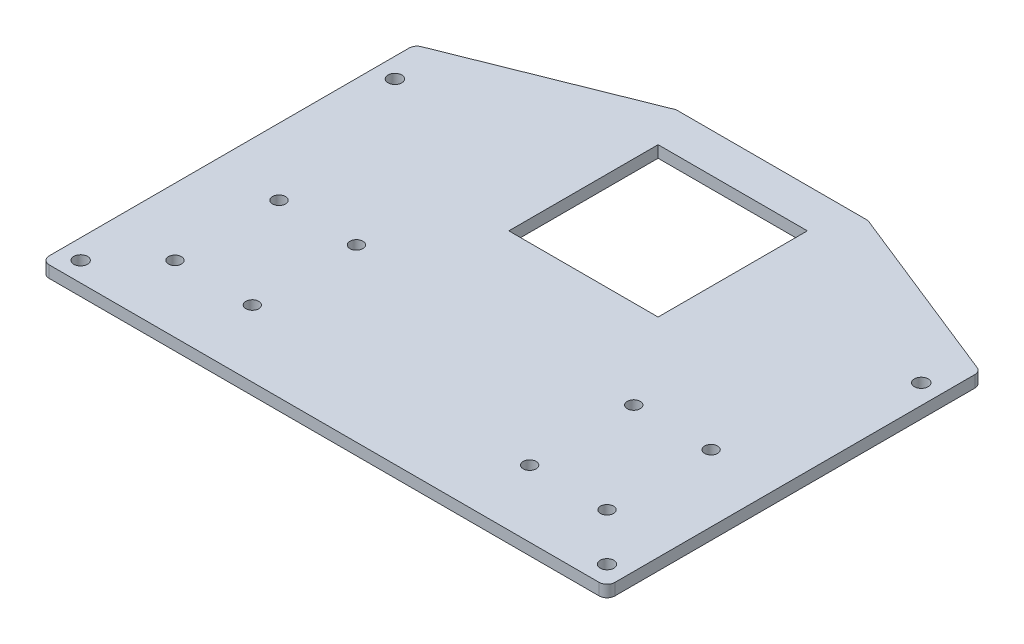
ISO-10303-21;
HEADER;
FILE_DESCRIPTION(('STEP AP214'),'2;1');
FILE_NAME('part.step','',(''),(''),'','','');
FILE_SCHEMA(('AUTOMOTIVE_DESIGN { 1 0 10303 214 1 1 1 1 }'));
ENDSEC;
DATA;
#1=APPLICATION_CONTEXT('core data for automotive mechanical design processes');
#2=APPLICATION_PROTOCOL_DEFINITION('international standard','automotive_design',2000,#1);
#3=PRODUCT_CONTEXT('',#1,'mechanical');
#4=PRODUCT('Part','Part','',(#3));
#5=PRODUCT_RELATED_PRODUCT_CATEGORY('part','',(#4));
#6=PRODUCT_DEFINITION_FORMATION('','',#4);
#7=PRODUCT_DEFINITION_CONTEXT('part definition',#1,'design');
#8=PRODUCT_DEFINITION('design','',#6,#7);
#9=PRODUCT_DEFINITION_SHAPE('','',#8);
#10=(LENGTH_UNIT() NAMED_UNIT(*) SI_UNIT(.MILLI.,.METRE.));
#11=(NAMED_UNIT(*) PLANE_ANGLE_UNIT() SI_UNIT($,.RADIAN.));
#12=(NAMED_UNIT(*) SI_UNIT($,.STERADIAN.) SOLID_ANGLE_UNIT());
#13=UNCERTAINTY_MEASURE_WITH_UNIT(LENGTH_MEASURE(1.E-05),#10,'distance_accuracy_value','');
#14=(GEOMETRIC_REPRESENTATION_CONTEXT(3) GLOBAL_UNCERTAINTY_ASSIGNED_CONTEXT((#13)) GLOBAL_UNIT_ASSIGNED_CONTEXT((#10,
#11,#12)) REPRESENTATION_CONTEXT('',''));
#15=CARTESIAN_POINT('',(0.,0.,0.));
#16=DIRECTION('',(0.,0.,1.));
#17=DIRECTION('',(1.,0.,0.));
#18=AXIS2_PLACEMENT_3D('',#15,#16,#17);
#19=CARTESIAN_POINT('',(-20.833630944789,3.,19.4787401060738));
#20=DIRECTION('',(0.,-1.,0.));
#21=DIRECTION('',(0.,0.,-1.));
#22=AXIS2_PLACEMENT_3D('',#19,#20,#21);
#23=PLANE('',#22);
#24=CARTESIAN_POINT('',(-17.833630944789,3.,16.4787401060738));
#25=DIRECTION('',(0.,1.,0.));
#26=DIRECTION('',(0.,0.,1.));
#27=AXIS2_PLACEMENT_3D('',#24,#25,#26);
#28=CIRCLE('',#27,1.75);
#29=CARTESIAN_POINT('',(-17.833630944789,3.,18.2287401060738));
#30=VERTEX_POINT('',#29);
#31=EDGE_CURVE('E189',#30,#30,#28,.T.);
#32=ORIENTED_EDGE('',*,*,#31,.F.);
#33=EDGE_LOOP('',(#32));
#34=FACE_BOUND('',#33,.T.);
#35=CARTESIAN_POINT('',(116.166369055211,3.,-63.5212598939262));
#36=DIRECTION('',(0.,1.,0.));
#37=DIRECTION('',(0.,0.,1.));
#38=AXIS2_PLACEMENT_3D('',#35,#36,#37);
#39=CIRCLE('',#38,1.75);
#40=CARTESIAN_POINT('',(116.166369055211,3.,-61.7712598939263));
#41=VERTEX_POINT('',#40);
#42=EDGE_CURVE('E194',#41,#41,#39,.T.);
#43=ORIENTED_EDGE('',*,*,#42,.F.);
#44=EDGE_LOOP('',(#43));
#45=FACE_BOUND('',#44,.T.);
#46=CARTESIAN_POINT('',(-17.833630944789,3.,-63.5212598939262));
#47=DIRECTION('',(0.,1.,0.));
#48=DIRECTION('',(0.,0.,1.));
#49=AXIS2_PLACEMENT_3D('',#46,#47,#48);
#50=CIRCLE('',#49,1.75);
#51=CARTESIAN_POINT('',(-17.833630944789,3.,-61.7712598939262));
#52=VERTEX_POINT('',#51);
#53=EDGE_CURVE('E184',#52,#52,#50,.T.);
#54=ORIENTED_EDGE('',*,*,#53,.F.);
#55=EDGE_LOOP('',(#54));
#56=FACE_BOUND('',#55,.T.);
#57=DIRECTION('',(-1.,0.,0.));
#58=VECTOR('',#57,1.);
#59=CARTESIAN_POINT('',(30.166369055211,3.,-82.5212598939263));
#60=LINE('',#59,#58);
#61=CARTESIAN_POINT('',(68.166369055211,3.,-82.5212598939263));
#62=VERTEX_POINT('',#61);
#63=CARTESIAN_POINT('',(30.166369055211,3.,-82.5212598939263));
#64=VERTEX_POINT('',#63);
#65=EDGE_CURVE('E167',#62,#64,#60,.T.);
#66=ORIENTED_EDGE('',*,*,#65,.F.);
#67=DIRECTION('',(0.,0.,-1.));
#68=VECTOR('',#67,1.);
#69=CARTESIAN_POINT('',(68.166369055211,3.,-82.5212598939263));
#70=LINE('',#69,#68);
#71=CARTESIAN_POINT('',(68.166369055211,3.,-44.5212598939263));
#72=VERTEX_POINT('',#71);
#73=EDGE_CURVE('E57',#72,#62,#70,.T.);
#74=ORIENTED_EDGE('',*,*,#73,.F.);
#75=DIRECTION('',(1.,0.,0.));
#76=VECTOR('',#75,1.);
#77=CARTESIAN_POINT('',(30.166369055211,3.,-44.5212598939263));
#78=LINE('',#77,#76);
#79=CARTESIAN_POINT('',(30.166369055211,3.,-44.5212598939263));
#80=VERTEX_POINT('',#79);
#81=EDGE_CURVE('E174',#80,#72,#78,.T.);
#82=ORIENTED_EDGE('',*,*,#81,.F.);
#83=DIRECTION('',(0.,0.,1.));
#84=VECTOR('',#83,1.);
#85=CARTESIAN_POINT('',(30.166369055211,3.,-82.5212598939263));
#86=LINE('',#85,#84);
#87=EDGE_CURVE('E157',#64,#80,#86,.T.);
#88=ORIENTED_EDGE('',*,*,#87,.F.);
#89=EDGE_LOOP('',(#66,#74,#82,#88));
#90=FACE_BOUND('',#89,.T.);
#91=CARTESIAN_POINT('',(116.166369055211,3.,16.4787401060738));
#92=DIRECTION('',(0.,1.,0.));
#93=DIRECTION('',(0.,0.,1.));
#94=AXIS2_PLACEMENT_3D('',#91,#92,#93);
#95=CIRCLE('',#94,1.75);
#96=CARTESIAN_POINT('',(116.166369055211,3.,18.2287401060738));
#97=VERTEX_POINT('',#96);
#98=EDGE_CURVE('E193',#97,#97,#95,.T.);
#99=ORIENTED_EDGE('',*,*,#98,.F.);
#100=EDGE_LOOP('',(#99));
#101=FACE_BOUND('',#100,.T.);
#102=CARTESIAN_POINT('',(84.4663690552109,3.,-22.0212598939262));
#103=DIRECTION('',(0.,1.,0.));
#104=DIRECTION('',(0.,0.,-1.));
#105=AXIS2_PLACEMENT_3D('',#102,#103,#104);
#106=CIRCLE('',#105,1.65);
#107=CARTESIAN_POINT('',(84.4663690552109,3.,-23.6712598939262));
#108=VERTEX_POINT('',#107);
#109=EDGE_CURVE('E325',#108,#108,#106,.T.);
#110=ORIENTED_EDGE('',*,*,#109,.F.);
#111=EDGE_LOOP('',(#110));
#112=FACE_BOUND('',#111,.T.);
#113=CARTESIAN_POINT('',(104.166369055211,3.,-22.0212598939262));
#114=DIRECTION('',(0.,1.,0.));
#115=DIRECTION('',(0.,0.,-1.));
#116=AXIS2_PLACEMENT_3D('',#113,#114,#115);
#117=CIRCLE('',#116,1.64999999999999);
#118=CARTESIAN_POINT('',(104.166369055211,3.,-23.6712598939262));
#119=VERTEX_POINT('',#118);
#120=EDGE_CURVE('E333',#119,#119,#117,.T.);
#121=ORIENTED_EDGE('',*,*,#120,.F.);
#122=EDGE_LOOP('',(#121));
#123=FACE_BOUND('',#122,.T.);
#124=CARTESIAN_POINT('',(104.166369055211,3.,4.47874010607376));
#125=DIRECTION('',(0.,1.,0.));
#126=DIRECTION('',(0.,0.,-1.));
#127=AXIS2_PLACEMENT_3D('',#124,#125,#126);
#128=CIRCLE('',#127,1.64999999999999);
#129=CARTESIAN_POINT('',(104.166369055211,3.,2.82874010607378));
#130=VERTEX_POINT('',#129);
#131=EDGE_CURVE('E341',#130,#130,#128,.T.);
#132=ORIENTED_EDGE('',*,*,#131,.F.);
#133=EDGE_LOOP('',(#132));
#134=FACE_BOUND('',#133,.T.);
#135=CARTESIAN_POINT('',(84.466369055211,3.,4.47874010607377));
#136=DIRECTION('',(0.,1.,0.));
#137=DIRECTION('',(0.,0.,-1.));
#138=AXIS2_PLACEMENT_3D('',#135,#136,#137);
#139=CIRCLE('',#138,1.65);
#140=CARTESIAN_POINT('',(84.466369055211,3.,2.82874010607377));
#141=VERTEX_POINT('',#140);
#142=EDGE_CURVE('E349',#141,#141,#139,.T.);
#143=ORIENTED_EDGE('',*,*,#142,.F.);
#144=EDGE_LOOP('',(#143));
#145=FACE_BOUND('',#144,.T.);
#146=CARTESIAN_POINT('',(13.866369055211,3.,4.47874010607378));
#147=DIRECTION('',(0.,1.,0.));
#148=DIRECTION('',(0.,0.,1.));
#149=AXIS2_PLACEMENT_3D('',#146,#147,#148);
#150=CIRCLE('',#149,1.65);
#151=CARTESIAN_POINT('',(13.866369055211,3.,6.12874010607378));
#152=VERTEX_POINT('',#151);
#153=EDGE_CURVE('E357',#152,#152,#150,.T.);
#154=ORIENTED_EDGE('',*,*,#153,.F.);
#155=EDGE_LOOP('',(#154));
#156=FACE_BOUND('',#155,.T.);
#157=CARTESIAN_POINT('',(-5.83363094478902,3.,4.47874010607378));
#158=DIRECTION('',(0.,1.,0.));
#159=DIRECTION('',(0.,0.,1.));
#160=AXIS2_PLACEMENT_3D('',#157,#158,#159);
#161=CIRCLE('',#160,1.65);
#162=CARTESIAN_POINT('',(-5.83363094478902,3.,6.12874010607378));
#163=VERTEX_POINT('',#162);
#164=EDGE_CURVE('E365',#163,#163,#161,.T.);
#165=ORIENTED_EDGE('',*,*,#164,.F.);
#166=EDGE_LOOP('',(#165));
#167=FACE_BOUND('',#166,.T.);
#168=CARTESIAN_POINT('',(13.866369055211,3.,-22.0212598939262));
#169=DIRECTION('',(0.,1.,0.));
#170=DIRECTION('',(0.,0.,1.));
#171=AXIS2_PLACEMENT_3D('',#168,#169,#170);
#172=CIRCLE('',#171,1.65);
#173=CARTESIAN_POINT('',(13.866369055211,3.,-20.3712598939262));
#174=VERTEX_POINT('',#173);
#175=EDGE_CURVE('E373',#174,#174,#172,.T.);
#176=ORIENTED_EDGE('',*,*,#175,.F.);
#177=EDGE_LOOP('',(#176));
#178=FACE_BOUND('',#177,.T.);
#179=CARTESIAN_POINT('',(-5.83363094478902,3.,-22.0212598939262));
#180=DIRECTION('',(0.,1.,0.));
#181=DIRECTION('',(0.,0.,1.));
#182=AXIS2_PLACEMENT_3D('',#179,#180,#181);
#183=CIRCLE('',#182,1.65);
#184=CARTESIAN_POINT('',(-5.83363094478902,3.,-20.3712598939262));
#185=VERTEX_POINT('',#184);
#186=EDGE_CURVE('E381',#185,#185,#183,.T.);
#187=ORIENTED_EDGE('',*,*,#186,.F.);
#188=EDGE_LOOP('',(#187));
#189=FACE_BOUND('',#188,.T.);
#190=CARTESIAN_POINT('',(119.166369055211,3.,19.4787401060738));
#191=DIRECTION('',(0.,-1.,0.));
#192=DIRECTION('',(0.,0.,-1.));
#193=AXIS2_PLACEMENT_3D('',#190,#191,#192);
#194=CIRCLE('',#193,1.99999999999999);
#195=CARTESIAN_POINT('',(121.166369055211,3.,19.4787401060737));
#196=VERTEX_POINT('',#195);
#197=CARTESIAN_POINT('',(119.166369055211,3.,21.4787401060738));
#198=VERTEX_POINT('',#197);
#199=EDGE_CURVE('E320',#196,#198,#194,.T.);
#200=ORIENTED_EDGE('',*,*,#199,.F.);
#201=DIRECTION('',(0.,0.,1.));
#202=VECTOR('',#201,1.);
#203=CARTESIAN_POINT('',(121.166369055211,3.,19.4787401060738));
#204=LINE('',#203,#202);
#205=CARTESIAN_POINT('',(121.166369055211,3.,-72.1360950867917));
#206=VERTEX_POINT('',#205);
#207=EDGE_CURVE('E317',#206,#196,#204,.T.);
#208=ORIENTED_EDGE('',*,*,#207,.F.);
#209=CARTESIAN_POINT('',(119.166369055211,3.,-72.1360950867917));
#210=DIRECTION('',(0.,-1.,0.));
#211=DIRECTION('',(0.,0.,-1.));
#212=AXIS2_PLACEMENT_3D('',#209,#210,#211);
#213=CIRCLE('',#212,2.00000000000001);
#214=CARTESIAN_POINT('',(119.909150407919,3.,-73.9930484685623));
#215=VERTEX_POINT('',#214);
#216=EDGE_CURVE('E314',#215,#206,#213,.T.);
#217=ORIENTED_EDGE('',*,*,#216,.F.);
#218=DIRECTION('',(0.92847669088526,0.,0.371390676354103));
#219=VECTOR('',#218,1.);
#220=CARTESIAN_POINT('',(30.8108177158038,3.,-109.632381545408));
#221=LINE('',#220,#219);
#222=CARTESIAN_POINT('',(73.9462383900829,3.,-92.3782132756968));
#223=VERTEX_POINT('',#222);
#224=EDGE_CURVE('E311',#223,#215,#221,.T.);
#225=ORIENTED_EDGE('',*,*,#224,.F.);
#226=CARTESIAN_POINT('',(73.2034570373747,3.,-90.5212598939262));
#227=DIRECTION('',(0.,-1.,0.));
#228=DIRECTION('',(0.,0.,-1.));
#229=AXIS2_PLACEMENT_3D('',#226,#227,#228);
#230=CIRCLE('',#229,2.00000000000001);
#231=CARTESIAN_POINT('',(73.2034570373747,3.,-92.5212598939262));
#232=VERTEX_POINT('',#231);
#233=EDGE_CURVE('E308',#232,#223,#230,.T.);
#234=ORIENTED_EDGE('',*,*,#233,.F.);
#235=DIRECTION('',(1.,0.,0.));
#236=VECTOR('',#235,1.);
#237=CARTESIAN_POINT('',(-20.833630944789,3.,-92.5212598939262));
#238=LINE('',#237,#236);
#239=CARTESIAN_POINT('',(25.1292810730472,3.,-92.5212598939262));
#240=VERTEX_POINT('',#239);
#241=EDGE_CURVE('E305',#240,#232,#238,.T.);
#242=ORIENTED_EDGE('',*,*,#241,.F.);
#243=CARTESIAN_POINT('',(25.1292810730472,3.,-90.5212598939262));
#244=DIRECTION('',(0.,-1.,0.));
#245=DIRECTION('',(0.,0.,-1.));
#246=AXIS2_PLACEMENT_3D('',#243,#244,#245);
#247=CIRCLE('',#246,2.);
#248=CARTESIAN_POINT('',(24.386499720339,3.,-92.3782132756968));
#249=VERTEX_POINT('',#248);
#250=EDGE_CURVE('E302',#249,#240,#247,.T.);
#251=ORIENTED_EDGE('',*,*,#250,.F.);
#252=DIRECTION('',(0.928476690885259,0.,-0.371390676354104));
#253=VECTOR('',#252,1.);
#254=CARTESIAN_POINT('',(-53.1677347777957,3.,-61.3565194764428));
#255=LINE('',#254,#253);
#256=CARTESIAN_POINT('',(-21.5764122974972,3.,-73.9930484685623));
#257=VERTEX_POINT('',#256);
#258=EDGE_CURVE('E299',#257,#249,#255,.T.);
#259=ORIENTED_EDGE('',*,*,#258,.F.);
#260=CARTESIAN_POINT('',(-20.833630944789,3.,-72.1360950867917));
#261=DIRECTION('',(0.,-1.,0.));
#262=DIRECTION('',(0.,0.,-1.));
#263=AXIS2_PLACEMENT_3D('',#260,#261,#262);
#264=CIRCLE('',#263,2.);
#265=CARTESIAN_POINT('',(-22.833630944789,3.,-72.1360950867917));
#266=VERTEX_POINT('',#265);
#267=EDGE_CURVE('E296',#266,#257,#264,.T.);
#268=ORIENTED_EDGE('',*,*,#267,.F.);
#269=DIRECTION('',(0.,0.,-1.));
#270=VECTOR('',#269,1.);
#271=CARTESIAN_POINT('',(-22.833630944789,3.,19.4787401060738));
#272=LINE('',#271,#270);
#273=CARTESIAN_POINT('',(-22.833630944789,3.,19.4787401060738));
#274=VERTEX_POINT('',#273);
#275=EDGE_CURVE('E293',#274,#266,#272,.T.);
#276=ORIENTED_EDGE('',*,*,#275,.F.);
#277=CARTESIAN_POINT('',(-20.833630944789,3.,19.4787401060738));
#278=DIRECTION('',(0.,-1.,0.));
#279=DIRECTION('',(0.,0.,-1.));
#280=AXIS2_PLACEMENT_3D('',#277,#278,#279);
#281=CIRCLE('',#280,1.99999999999999);
#282=CARTESIAN_POINT('',(-20.833630944789,3.,21.4787401060738));
#283=VERTEX_POINT('',#282);
#284=EDGE_CURVE('E290',#283,#274,#281,.T.);
#285=ORIENTED_EDGE('',*,*,#284,.F.);
#286=DIRECTION('',(-1.,0.,0.));
#287=VECTOR('',#286,1.);
#288=CARTESIAN_POINT('',(-20.833630944789,3.,21.4787401060738));
#289=LINE('',#288,#287);
#290=EDGE_CURVE('E254',#198,#283,#289,.T.);
#291=ORIENTED_EDGE('',*,*,#290,.F.);
#292=EDGE_LOOP('',(#200,#208,#217,#225,#234,#242,#251,#259,#268,#276,#285,#291));
#293=FACE_BOUND('',#292,.T.);
#294=ADVANCED_FACE('F39',(#34,#45,#56,#90,#101,#112,#123,#134,#145,#156,#167,#178,#189,#293),
#23,.F.);
#295=CARTESIAN_POINT('',(-20.833630944789,0.,19.4787401060738));
#296=DIRECTION('',(0.,-1.,0.));
#297=DIRECTION('',(0.,0.,-1.));
#298=AXIS2_PLACEMENT_3D('',#295,#296,#297);
#299=PLANE('',#298);
#300=CARTESIAN_POINT('',(-17.833630944789,0.,16.4787401060738));
#301=DIRECTION('',(0.,-1.,0.));
#302=DIRECTION('',(0.,0.,-1.));
#303=AXIS2_PLACEMENT_3D('',#300,#301,#302);
#304=CIRCLE('',#303,1.75);
#305=CARTESIAN_POINT('',(-17.833630944789,0.,14.7287401060738));
#306=VERTEX_POINT('',#305);
#307=EDGE_CURVE('E43',#306,#306,#304,.T.);
#308=ORIENTED_EDGE('',*,*,#307,.F.);
#309=EDGE_LOOP('',(#308));
#310=FACE_BOUND('',#309,.T.);
#311=CARTESIAN_POINT('',(116.166369055211,0.,-63.5212598939262));
#312=DIRECTION('',(0.,-1.,0.));
#313=DIRECTION('',(0.,0.,-1.));
#314=AXIS2_PLACEMENT_3D('',#311,#312,#313);
#315=CIRCLE('',#314,1.75);
#316=CARTESIAN_POINT('',(116.166369055211,0.,-65.2712598939263));
#317=VERTEX_POINT('',#316);
#318=EDGE_CURVE('E401',#317,#317,#315,.T.);
#319=ORIENTED_EDGE('',*,*,#318,.F.);
#320=EDGE_LOOP('',(#319));
#321=FACE_BOUND('',#320,.T.);
#322=CARTESIAN_POINT('',(-17.833630944789,0.,-63.5212598939262));
#323=DIRECTION('',(0.,-1.,0.));
#324=DIRECTION('',(0.,0.,-1.));
#325=AXIS2_PLACEMENT_3D('',#322,#323,#324);
#326=CIRCLE('',#325,1.75);
#327=CARTESIAN_POINT('',(-17.833630944789,0.,-65.2712598939263));
#328=VERTEX_POINT('',#327);
#329=EDGE_CURVE('E392',#328,#328,#326,.T.);
#330=ORIENTED_EDGE('',*,*,#329,.F.);
#331=EDGE_LOOP('',(#330));
#332=FACE_BOUND('',#331,.T.);
#333=DIRECTION('',(0.,0.,1.));
#334=VECTOR('',#333,1.);
#335=CARTESIAN_POINT('',(68.166369055211,0.,19.4787401060737));
#336=LINE('',#335,#334);
#337=CARTESIAN_POINT('',(68.166369055211,0.,-82.5212598939263));
#338=VERTEX_POINT('',#337);
#339=CARTESIAN_POINT('',(68.166369055211,0.,-44.5212598939263));
#340=VERTEX_POINT('',#339);
#341=EDGE_CURVE('E11',#338,#340,#336,.T.);
#342=ORIENTED_EDGE('',*,*,#341,.F.);
#343=DIRECTION('',(1.,0.,0.));
#344=VECTOR('',#343,1.);
#345=CARTESIAN_POINT('',(-20.833630944789,0.,-82.5212598939263));
#346=LINE('',#345,#344);
#347=CARTESIAN_POINT('',(30.166369055211,0.,-82.5212598939263));
#348=VERTEX_POINT('',#347);
#349=EDGE_CURVE('E385',#348,#338,#346,.T.);
#350=ORIENTED_EDGE('',*,*,#349,.F.);
#351=DIRECTION('',(0.,0.,-1.));
#352=VECTOR('',#351,1.);
#353=CARTESIAN_POINT('',(30.166369055211,0.,19.4787401060738));
#354=LINE('',#353,#352);
#355=CARTESIAN_POINT('',(30.166369055211,0.,-44.5212598939263));
#356=VERTEX_POINT('',#355);
#357=EDGE_CURVE('E160',#356,#348,#354,.T.);
#358=ORIENTED_EDGE('',*,*,#357,.F.);
#359=DIRECTION('',(-1.,0.,0.));
#360=VECTOR('',#359,1.);
#361=CARTESIAN_POINT('',(-20.833630944789,0.,-44.5212598939263));
#362=LINE('',#361,#360);
#363=EDGE_CURVE('E49',#340,#356,#362,.T.);
#364=ORIENTED_EDGE('',*,*,#363,.F.);
#365=EDGE_LOOP('',(#342,#350,#358,#364));
#366=FACE_BOUND('',#365,.T.);
#367=CARTESIAN_POINT('',(116.166369055211,0.,16.4787401060738));
#368=DIRECTION('',(0.,-1.,0.));
#369=DIRECTION('',(0.,0.,-1.));
#370=AXIS2_PLACEMENT_3D('',#367,#368,#369);
#371=CIRCLE('',#370,1.75);
#372=CARTESIAN_POINT('',(116.166369055211,0.,14.7287401060738));
#373=VERTEX_POINT('',#372);
#374=EDGE_CURVE('E201',#373,#373,#371,.T.);
#375=ORIENTED_EDGE('',*,*,#374,.F.);
#376=EDGE_LOOP('',(#375));
#377=FACE_BOUND('',#376,.T.);
#378=CARTESIAN_POINT('',(84.4663690552109,0.,-22.0212598939262));
#379=DIRECTION('',(0.,1.,0.));
#380=DIRECTION('',(0.,0.,-1.));
#381=AXIS2_PLACEMENT_3D('',#378,#379,#380);
#382=CIRCLE('',#381,1.65);
#383=CARTESIAN_POINT('',(84.4663690552109,0.,-23.6712598939262));
#384=VERTEX_POINT('',#383);
#385=EDGE_CURVE('E324',#384,#384,#382,.T.);
#386=ORIENTED_EDGE('',*,*,#385,.T.);
#387=EDGE_LOOP('',(#386));
#388=FACE_BOUND('',#387,.T.);
#389=CARTESIAN_POINT('',(104.166369055211,0.,4.47874010607376));
#390=DIRECTION('',(0.,1.,0.));
#391=DIRECTION('',(0.,0.,-1.));
#392=AXIS2_PLACEMENT_3D('',#389,#390,#391);
#393=CIRCLE('',#392,1.64999999999999);
#394=CARTESIAN_POINT('',(104.166369055211,0.,2.82874010607378));
#395=VERTEX_POINT('',#394);
#396=EDGE_CURVE('E337',#395,#395,#393,.T.);
#397=ORIENTED_EDGE('',*,*,#396,.T.);
#398=EDGE_LOOP('',(#397));
#399=FACE_BOUND('',#398,.T.);
#400=CARTESIAN_POINT('',(13.866369055211,0.,4.47874010607378));
#401=DIRECTION('',(0.,1.,0.));
#402=DIRECTION('',(0.,0.,1.));
#403=AXIS2_PLACEMENT_3D('',#400,#401,#402);
#404=CIRCLE('',#403,1.65);
#405=CARTESIAN_POINT('',(13.866369055211,0.,6.12874010607378));
#406=VERTEX_POINT('',#405);
#407=EDGE_CURVE('E353',#406,#406,#404,.T.);
#408=ORIENTED_EDGE('',*,*,#407,.T.);
#409=EDGE_LOOP('',(#408));
#410=FACE_BOUND('',#409,.T.);
#411=CARTESIAN_POINT('',(13.866369055211,0.,-22.0212598939262));
#412=DIRECTION('',(0.,1.,0.));
#413=DIRECTION('',(0.,0.,1.));
#414=AXIS2_PLACEMENT_3D('',#411,#412,#413);
#415=CIRCLE('',#414,1.65);
#416=CARTESIAN_POINT('',(13.866369055211,0.,-20.3712598939262));
#417=VERTEX_POINT('',#416);
#418=EDGE_CURVE('E369',#417,#417,#415,.T.);
#419=ORIENTED_EDGE('',*,*,#418,.T.);
#420=EDGE_LOOP('',(#419));
#421=FACE_BOUND('',#420,.T.);
#422=CARTESIAN_POINT('',(-5.83363094478902,0.,-22.0212598939262));
#423=DIRECTION('',(0.,1.,0.));
#424=DIRECTION('',(0.,0.,1.));
#425=AXIS2_PLACEMENT_3D('',#422,#423,#424);
#426=CIRCLE('',#425,1.65);
#427=CARTESIAN_POINT('',(-5.83363094478902,0.,-20.3712598939262));
#428=VERTEX_POINT('',#427);
#429=EDGE_CURVE('E377',#428,#428,#426,.T.);
#430=ORIENTED_EDGE('',*,*,#429,.T.);
#431=EDGE_LOOP('',(#430));
#432=FACE_BOUND('',#431,.T.);
#433=CARTESIAN_POINT('',(-5.83363094478902,0.,4.47874010607378));
#434=DIRECTION('',(0.,1.,0.));
#435=DIRECTION('',(0.,0.,1.));
#436=AXIS2_PLACEMENT_3D('',#433,#434,#435);
#437=CIRCLE('',#436,1.65);
#438=CARTESIAN_POINT('',(-5.83363094478902,0.,6.12874010607378));
#439=VERTEX_POINT('',#438);
#440=EDGE_CURVE('E361',#439,#439,#437,.T.);
#441=ORIENTED_EDGE('',*,*,#440,.T.);
#442=EDGE_LOOP('',(#441));
#443=FACE_BOUND('',#442,.T.);
#444=CARTESIAN_POINT('',(84.466369055211,0.,4.47874010607377));
#445=DIRECTION('',(0.,1.,0.));
#446=DIRECTION('',(0.,0.,-1.));
#447=AXIS2_PLACEMENT_3D('',#444,#445,#446);
#448=CIRCLE('',#447,1.65);
#449=CARTESIAN_POINT('',(84.466369055211,0.,2.82874010607377));
#450=VERTEX_POINT('',#449);
#451=EDGE_CURVE('E345',#450,#450,#448,.T.);
#452=ORIENTED_EDGE('',*,*,#451,.T.);
#453=EDGE_LOOP('',(#452));
#454=FACE_BOUND('',#453,.T.);
#455=CARTESIAN_POINT('',(104.166369055211,0.,-22.0212598939262));
#456=DIRECTION('',(0.,1.,0.));
#457=DIRECTION('',(0.,0.,-1.));
#458=AXIS2_PLACEMENT_3D('',#455,#456,#457);
#459=CIRCLE('',#458,1.64999999999999);
#460=CARTESIAN_POINT('',(104.166369055211,0.,-23.6712598939262));
#461=VERTEX_POINT('',#460);
#462=EDGE_CURVE('E329',#461,#461,#459,.T.);
#463=ORIENTED_EDGE('',*,*,#462,.T.);
#464=EDGE_LOOP('',(#463));
#465=FACE_BOUND('',#464,.T.);
#466=DIRECTION('',(0.,0.,1.));
#467=VECTOR('',#466,1.);
#468=CARTESIAN_POINT('',(121.166369055211,0.,-72.1360950867917));
#469=LINE('',#468,#467);
#470=CARTESIAN_POINT('',(121.166369055211,0.,-72.1360950867917));
#471=VERTEX_POINT('',#470);
#472=CARTESIAN_POINT('',(121.166369055211,0.,19.4787401060737));
#473=VERTEX_POINT('',#472);
#474=EDGE_CURVE('E246',#471,#473,#469,.T.);
#475=ORIENTED_EDGE('',*,*,#474,.T.);
#476=CARTESIAN_POINT('',(119.166369055211,0.,19.4787401060738));
#477=DIRECTION('',(0.,-1.,0.));
#478=DIRECTION('',(0.,0.,-1.));
#479=AXIS2_PLACEMENT_3D('',#476,#477,#478);
#480=CIRCLE('',#479,1.99999999999999);
#481=CARTESIAN_POINT('',(119.166369055211,0.,21.4787401060738));
#482=VERTEX_POINT('',#481);
#483=EDGE_CURVE('E202',#473,#482,#480,.T.);
#484=ORIENTED_EDGE('',*,*,#483,.T.);
#485=DIRECTION('',(-1.,0.,0.));
#486=VECTOR('',#485,1.);
#487=CARTESIAN_POINT('',(119.166369055211,0.,21.4787401060738));
#488=LINE('',#487,#486);
#489=CARTESIAN_POINT('',(-20.833630944789,0.,21.4787401060738));
#490=VERTEX_POINT('',#489);
#491=EDGE_CURVE('E206',#482,#490,#488,.T.);
#492=ORIENTED_EDGE('',*,*,#491,.T.);
#493=CARTESIAN_POINT('',(-20.833630944789,0.,19.4787401060738));
#494=DIRECTION('',(0.,-1.,0.));
#495=DIRECTION('',(0.,0.,-1.));
#496=AXIS2_PLACEMENT_3D('',#493,#494,#495);
#497=CIRCLE('',#496,1.99999999999999);
#498=CARTESIAN_POINT('',(-22.833630944789,0.,19.4787401060738));
#499=VERTEX_POINT('',#498);
#500=EDGE_CURVE('E210',#490,#499,#497,.T.);
#501=ORIENTED_EDGE('',*,*,#500,.T.);
#502=DIRECTION('',(0.,0.,-1.));
#503=VECTOR('',#502,1.);
#504=CARTESIAN_POINT('',(-22.833630944789,0.,19.4787401060738));
#505=LINE('',#504,#503);
#506=CARTESIAN_POINT('',(-22.833630944789,0.,-72.1360950867917));
#507=VERTEX_POINT('',#506);
#508=EDGE_CURVE('E214',#499,#507,#505,.T.);
#509=ORIENTED_EDGE('',*,*,#508,.T.);
#510=CARTESIAN_POINT('',(-20.833630944789,0.,-72.1360950867917));
#511=DIRECTION('',(0.,-1.,0.));
#512=DIRECTION('',(0.,0.,-1.));
#513=AXIS2_PLACEMENT_3D('',#510,#511,#512);
#514=CIRCLE('',#513,2.);
#515=CARTESIAN_POINT('',(-21.5764122974972,0.,-73.9930484685623));
#516=VERTEX_POINT('',#515);
#517=EDGE_CURVE('E218',#507,#516,#514,.T.);
#518=ORIENTED_EDGE('',*,*,#517,.T.);
#519=DIRECTION('',(0.928476690885259,0.,-0.371390676354104));
#520=VECTOR('',#519,1.);
#521=CARTESIAN_POINT('',(-21.5764122974972,0.,-73.9930484685623));
#522=LINE('',#521,#520);
#523=CARTESIAN_POINT('',(24.386499720339,0.,-92.3782132756968));
#524=VERTEX_POINT('',#523);
#525=EDGE_CURVE('E222',#516,#524,#522,.T.);
#526=ORIENTED_EDGE('',*,*,#525,.T.);
#527=CARTESIAN_POINT('',(25.1292810730472,0.,-90.5212598939262));
#528=DIRECTION('',(0.,-1.,0.));
#529=DIRECTION('',(0.,0.,-1.));
#530=AXIS2_PLACEMENT_3D('',#527,#528,#529);
#531=CIRCLE('',#530,2.);
#532=CARTESIAN_POINT('',(25.1292810730472,0.,-92.5212598939262));
#533=VERTEX_POINT('',#532);
#534=EDGE_CURVE('E226',#524,#533,#531,.T.);
#535=ORIENTED_EDGE('',*,*,#534,.T.);
#536=DIRECTION('',(1.,0.,0.));
#537=VECTOR('',#536,1.);
#538=CARTESIAN_POINT('',(25.1292810730472,0.,-92.5212598939262));
#539=LINE('',#538,#537);
#540=CARTESIAN_POINT('',(73.2034570373747,0.,-92.5212598939262));
#541=VERTEX_POINT('',#540);
#542=EDGE_CURVE('E230',#533,#541,#539,.T.);
#543=ORIENTED_EDGE('',*,*,#542,.T.);
#544=CARTESIAN_POINT('',(73.2034570373747,0.,-90.5212598939262));
#545=DIRECTION('',(0.,-1.,0.));
#546=DIRECTION('',(0.,0.,-1.));
#547=AXIS2_PLACEMENT_3D('',#544,#545,#546);
#548=CIRCLE('',#547,2.00000000000001);
#549=CARTESIAN_POINT('',(73.9462383900829,0.,-92.3782132756968));
#550=VERTEX_POINT('',#549);
#551=EDGE_CURVE('E234',#541,#550,#548,.T.);
#552=ORIENTED_EDGE('',*,*,#551,.T.);
#553=DIRECTION('',(0.92847669088526,0.,0.371390676354103));
#554=VECTOR('',#553,1.);
#555=CARTESIAN_POINT('',(73.9462383900829,0.,-92.3782132756967));
#556=LINE('',#555,#554);
#557=CARTESIAN_POINT('',(119.909150407919,0.,-73.9930484685623));
#558=VERTEX_POINT('',#557);
#559=EDGE_CURVE('E238',#550,#558,#556,.T.);
#560=ORIENTED_EDGE('',*,*,#559,.T.);
#561=CARTESIAN_POINT('',(119.166369055211,0.,-72.1360950867917));
#562=DIRECTION('',(0.,-1.,0.));
#563=DIRECTION('',(0.,0.,-1.));
#564=AXIS2_PLACEMENT_3D('',#561,#562,#563);
#565=CIRCLE('',#564,2.00000000000001);
#566=EDGE_CURVE('E242',#558,#471,#565,.T.);
#567=ORIENTED_EDGE('',*,*,#566,.T.);
#568=EDGE_LOOP('',(#475,#484,#492,#501,#509,#518,#526,#535,#543,#552,#560,#567));
#569=FACE_BOUND('',#568,.T.);
#570=ADVANCED_FACE('F41',(#310,#321,#332,#366,#377,#388,#399,#410,#421,#432,#443,#454,#465,
#569),#299,.T.);
#571=CARTESIAN_POINT('',(-5.83363094478902,3.,-22.0212598939262));
#572=DIRECTION('',(0.,-1.,0.));
#573=DIRECTION('',(0.,0.,-1.));
#574=AXIS2_PLACEMENT_3D('',#571,#572,#573);
#575=CYLINDRICAL_SURFACE('',#574,1.65);
#576=ORIENTED_EDGE('',*,*,#186,.T.);
#577=EDGE_LOOP('',(#576));
#578=FACE_BOUND('',#577,.T.);
#579=ORIENTED_EDGE('',*,*,#429,.F.);
#580=EDGE_LOOP('',(#579));
#581=FACE_BOUND('',#580,.T.);
#582=ADVANCED_FACE('F415',(#578,#581),#575,.F.);
#583=CARTESIAN_POINT('',(13.866369055211,3.,-22.0212598939262));
#584=DIRECTION('',(0.,-1.,0.));
#585=DIRECTION('',(0.,0.,-1.));
#586=AXIS2_PLACEMENT_3D('',#583,#584,#585);
#587=CYLINDRICAL_SURFACE('',#586,1.65);
#588=ORIENTED_EDGE('',*,*,#175,.T.);
#589=EDGE_LOOP('',(#588));
#590=FACE_BOUND('',#589,.T.);
#591=ORIENTED_EDGE('',*,*,#418,.F.);
#592=EDGE_LOOP('',(#591));
#593=FACE_BOUND('',#592,.T.);
#594=ADVANCED_FACE('F508',(#590,#593),#587,.F.);
#595=CARTESIAN_POINT('',(-5.83363094478902,3.,4.47874010607378));
#596=DIRECTION('',(0.,-1.,0.));
#597=DIRECTION('',(0.,0.,-1.));
#598=AXIS2_PLACEMENT_3D('',#595,#596,#597);
#599=CYLINDRICAL_SURFACE('',#598,1.65);
#600=ORIENTED_EDGE('',*,*,#164,.T.);
#601=EDGE_LOOP('',(#600));
#602=FACE_BOUND('',#601,.T.);
#603=ORIENTED_EDGE('',*,*,#440,.F.);
#604=EDGE_LOOP('',(#603));
#605=FACE_BOUND('',#604,.T.);
#606=ADVANCED_FACE('F512',(#602,#605),#599,.F.);
#607=CARTESIAN_POINT('',(13.866369055211,3.,4.47874010607378));
#608=DIRECTION('',(0.,-1.,0.));
#609=DIRECTION('',(0.,0.,-1.));
#610=AXIS2_PLACEMENT_3D('',#607,#608,#609);
#611=CYLINDRICAL_SURFACE('',#610,1.65);
#612=ORIENTED_EDGE('',*,*,#153,.T.);
#613=EDGE_LOOP('',(#612));
#614=FACE_BOUND('',#613,.T.);
#615=ORIENTED_EDGE('',*,*,#407,.F.);
#616=EDGE_LOOP('',(#615));
#617=FACE_BOUND('',#616,.T.);
#618=ADVANCED_FACE('F516',(#614,#617),#611,.F.);
#619=CARTESIAN_POINT('',(84.466369055211,3.,4.47874010607377));
#620=DIRECTION('',(0.,-1.,0.));
#621=DIRECTION('',(0.,0.,-1.));
#622=AXIS2_PLACEMENT_3D('',#619,#620,#621);
#623=CYLINDRICAL_SURFACE('',#622,1.65);
#624=ORIENTED_EDGE('',*,*,#142,.T.);
#625=EDGE_LOOP('',(#624));
#626=FACE_BOUND('',#625,.T.);
#627=ORIENTED_EDGE('',*,*,#451,.F.);
#628=EDGE_LOOP('',(#627));
#629=FACE_BOUND('',#628,.T.);
#630=ADVANCED_FACE('F520',(#626,#629),#623,.F.);
#631=CARTESIAN_POINT('',(104.166369055211,3.,4.47874010607376));
#632=DIRECTION('',(0.,-1.,0.));
#633=DIRECTION('',(0.,0.,-1.));
#634=AXIS2_PLACEMENT_3D('',#631,#632,#633);
#635=CYLINDRICAL_SURFACE('',#634,1.64999999999999);
#636=ORIENTED_EDGE('',*,*,#131,.T.);
#637=EDGE_LOOP('',(#636));
#638=FACE_BOUND('',#637,.T.);
#639=ORIENTED_EDGE('',*,*,#396,.F.);
#640=EDGE_LOOP('',(#639));
#641=FACE_BOUND('',#640,.T.);
#642=ADVANCED_FACE('F524',(#638,#641),#635,.F.);
#643=CARTESIAN_POINT('',(104.166369055211,3.,-22.0212598939262));
#644=DIRECTION('',(0.,-1.,0.));
#645=DIRECTION('',(0.,0.,-1.));
#646=AXIS2_PLACEMENT_3D('',#643,#644,#645);
#647=CYLINDRICAL_SURFACE('',#646,1.64999999999999);
#648=ORIENTED_EDGE('',*,*,#120,.T.);
#649=EDGE_LOOP('',(#648));
#650=FACE_BOUND('',#649,.T.);
#651=ORIENTED_EDGE('',*,*,#462,.F.);
#652=EDGE_LOOP('',(#651));
#653=FACE_BOUND('',#652,.T.);
#654=ADVANCED_FACE('F528',(#650,#653),#647,.F.);
#655=CARTESIAN_POINT('',(84.4663690552109,3.,-22.0212598939262));
#656=DIRECTION('',(0.,-1.,0.));
#657=DIRECTION('',(0.,0.,-1.));
#658=AXIS2_PLACEMENT_3D('',#655,#656,#657);
#659=CYLINDRICAL_SURFACE('',#658,1.65);
#660=ORIENTED_EDGE('',*,*,#109,.T.);
#661=EDGE_LOOP('',(#660));
#662=FACE_BOUND('',#661,.T.);
#663=ORIENTED_EDGE('',*,*,#385,.F.);
#664=EDGE_LOOP('',(#663));
#665=FACE_BOUND('',#664,.T.);
#666=ADVANCED_FACE('F532',(#662,#665),#659,.F.);
#667=CARTESIAN_POINT('',(119.166369055211,10.,19.4787401060738));
#668=DIRECTION('',(0.,-1.,0.));
#669=DIRECTION('',(0.,0.,-1.));
#670=AXIS2_PLACEMENT_3D('',#667,#668,#669);
#671=CYLINDRICAL_SURFACE('',#670,1.99999999999999);
#672=ORIENTED_EDGE('',*,*,#199,.T.);
#673=DIRECTION('',(0.,-1.,0.));
#674=VECTOR('',#673,1.);
#675=CARTESIAN_POINT('',(119.166369055211,10.,21.4787401060738));
#676=LINE('',#675,#674);
#677=EDGE_CURVE('E250',#198,#482,#676,.T.);
#678=ORIENTED_EDGE('',*,*,#677,.T.);
#679=ORIENTED_EDGE('',*,*,#483,.F.);
#680=DIRECTION('',(0.,-1.,0.));
#681=VECTOR('',#680,1.);
#682=CARTESIAN_POINT('',(121.166369055211,10.,19.4787401060737));
#683=LINE('',#682,#681);
#684=EDGE_CURVE('E251',#196,#473,#683,.T.);
#685=ORIENTED_EDGE('',*,*,#684,.F.);
#686=EDGE_LOOP('',(#672,#678,#679,#685));
#687=FACE_BOUND('',#686,.T.);
#688=ADVANCED_FACE('F450',(#687),#671,.T.);
#689=CARTESIAN_POINT('',(121.166369055211,10.,-72.1360950867917));
#690=DIRECTION('',(1.,0.,0.));
#691=DIRECTION('',(0.,0.,-1.));
#692=AXIS2_PLACEMENT_3D('',#689,#690,#691);
#693=PLANE('',#692);
#694=ORIENTED_EDGE('',*,*,#207,.T.);
#695=ORIENTED_EDGE('',*,*,#684,.T.);
#696=ORIENTED_EDGE('',*,*,#474,.F.);
#697=DIRECTION('',(0.,-1.,0.));
#698=VECTOR('',#697,1.);
#699=CARTESIAN_POINT('',(121.166369055211,10.,-72.1360950867917));
#700=LINE('',#699,#698);
#701=EDGE_CURVE('E255',#206,#471,#700,.T.);
#702=ORIENTED_EDGE('',*,*,#701,.F.);
#703=EDGE_LOOP('',(#694,#695,#696,#702));
#704=FACE_BOUND('',#703,.T.);
#705=ADVANCED_FACE('F445',(#704),#693,.T.);
#706=CARTESIAN_POINT('',(119.166369055211,10.,-72.1360950867917));
#707=DIRECTION('',(0.,-1.,0.));
#708=DIRECTION('',(0.,0.,-1.));
#709=AXIS2_PLACEMENT_3D('',#706,#707,#708);
#710=CYLINDRICAL_SURFACE('',#709,2.00000000000001);
#711=ORIENTED_EDGE('',*,*,#216,.T.);
#712=ORIENTED_EDGE('',*,*,#701,.T.);
#713=ORIENTED_EDGE('',*,*,#566,.F.);
#714=DIRECTION('',(0.,-1.,0.));
#715=VECTOR('',#714,1.);
#716=CARTESIAN_POINT('',(119.909150407919,10.,-73.9930484685623));
#717=LINE('',#716,#715);
#718=EDGE_CURVE('E258',#215,#558,#717,.T.);
#719=ORIENTED_EDGE('',*,*,#718,.F.);
#720=EDGE_LOOP('',(#711,#712,#713,#719));
#721=FACE_BOUND('',#720,.T.);
#722=ADVANCED_FACE('F497',(#721),#710,.T.);
#723=CARTESIAN_POINT('',(73.9462383900829,10.,-92.3782132756967));
#724=DIRECTION('',(0.371390676354103,0.,-0.92847669088526));
#725=DIRECTION('',(-0.92847669088526,0.,-0.371390676354103));
#726=AXIS2_PLACEMENT_3D('',#723,#724,#725);
#727=PLANE('',#726);
#728=ORIENTED_EDGE('',*,*,#224,.T.);
#729=ORIENTED_EDGE('',*,*,#718,.T.);
#730=ORIENTED_EDGE('',*,*,#559,.F.);
#731=DIRECTION('',(0.,-1.,0.));
#732=VECTOR('',#731,1.);
#733=CARTESIAN_POINT('',(73.9462383900829,10.,-92.3782132756968));
#734=LINE('',#733,#732);
#735=EDGE_CURVE('E261',#223,#550,#734,.T.);
#736=ORIENTED_EDGE('',*,*,#735,.F.);
#737=EDGE_LOOP('',(#728,#729,#730,#736));
#738=FACE_BOUND('',#737,.T.);
#739=ADVANCED_FACE('F493',(#738),#727,.T.);
#740=CARTESIAN_POINT('',(73.2034570373747,10.,-90.5212598939262));
#741=DIRECTION('',(0.,-1.,0.));
#742=DIRECTION('',(0.,0.,-1.));
#743=AXIS2_PLACEMENT_3D('',#740,#741,#742);
#744=CYLINDRICAL_SURFACE('',#743,2.00000000000001);
#745=ORIENTED_EDGE('',*,*,#233,.T.);
#746=ORIENTED_EDGE('',*,*,#735,.T.);
#747=ORIENTED_EDGE('',*,*,#551,.F.);
#748=DIRECTION('',(0.,-1.,0.));
#749=VECTOR('',#748,1.);
#750=CARTESIAN_POINT('',(73.2034570373747,10.,-92.5212598939262));
#751=LINE('',#750,#749);
#752=EDGE_CURVE('E264',#232,#541,#751,.T.);
#753=ORIENTED_EDGE('',*,*,#752,.F.);
#754=EDGE_LOOP('',(#745,#746,#747,#753));
#755=FACE_BOUND('',#754,.T.);
#756=ADVANCED_FACE('F488',(#755),#744,.T.);
#757=CARTESIAN_POINT('',(25.1292810730472,10.,-92.5212598939262));
#758=DIRECTION('',(0.,0.,-1.));
#759=DIRECTION('',(-1.,0.,0.));
#760=AXIS2_PLACEMENT_3D('',#757,#758,#759);
#761=PLANE('',#760);
#762=ORIENTED_EDGE('',*,*,#241,.T.);
#763=ORIENTED_EDGE('',*,*,#752,.T.);
#764=ORIENTED_EDGE('',*,*,#542,.F.);
#765=DIRECTION('',(0.,-1.,0.));
#766=VECTOR('',#765,1.);
#767=CARTESIAN_POINT('',(25.1292810730472,10.,-92.5212598939262));
#768=LINE('',#767,#766);
#769=EDGE_CURVE('E267',#240,#533,#768,.T.);
#770=ORIENTED_EDGE('',*,*,#769,.F.);
#771=EDGE_LOOP('',(#762,#763,#764,#770));
#772=FACE_BOUND('',#771,.T.);
#773=ADVANCED_FACE('F483',(#772),#761,.T.);
#774=CARTESIAN_POINT('',(25.1292810730472,10.,-90.5212598939262));
#775=DIRECTION('',(0.,-1.,0.));
#776=DIRECTION('',(0.,0.,-1.));
#777=AXIS2_PLACEMENT_3D('',#774,#775,#776);
#778=CYLINDRICAL_SURFACE('',#777,2.);
#779=ORIENTED_EDGE('',*,*,#250,.T.);
#780=ORIENTED_EDGE('',*,*,#769,.T.);
#781=ORIENTED_EDGE('',*,*,#534,.F.);
#782=DIRECTION('',(0.,-1.,0.));
#783=VECTOR('',#782,1.);
#784=CARTESIAN_POINT('',(24.386499720339,10.,-92.3782132756968));
#785=LINE('',#784,#783);
#786=EDGE_CURVE('E270',#249,#524,#785,.T.);
#787=ORIENTED_EDGE('',*,*,#786,.F.);
#788=EDGE_LOOP('',(#779,#780,#781,#787));
#789=FACE_BOUND('',#788,.T.);
#790=ADVANCED_FACE('F478',(#789),#778,.T.);
#791=CARTESIAN_POINT('',(-21.5764122974972,10.,-73.9930484685623));
#792=DIRECTION('',(-0.371390676354104,0.,-0.928476690885259));
#793=DIRECTION('',(-0.928476690885259,0.,0.371390676354104));
#794=AXIS2_PLACEMENT_3D('',#791,#792,#793);
#795=PLANE('',#794);
#796=ORIENTED_EDGE('',*,*,#258,.T.);
#797=ORIENTED_EDGE('',*,*,#786,.T.);
#798=ORIENTED_EDGE('',*,*,#525,.F.);
#799=DIRECTION('',(0.,-1.,0.));
#800=VECTOR('',#799,1.);
#801=CARTESIAN_POINT('',(-21.5764122974972,10.,-73.9930484685623));
#802=LINE('',#801,#800);
#803=EDGE_CURVE('E273',#257,#516,#802,.T.);
#804=ORIENTED_EDGE('',*,*,#803,.F.);
#805=EDGE_LOOP('',(#796,#797,#798,#804));
#806=FACE_BOUND('',#805,.T.);
#807=ADVANCED_FACE('F473',(#806),#795,.T.);
#808=CARTESIAN_POINT('',(-20.833630944789,10.,-72.1360950867917));
#809=DIRECTION('',(0.,-1.,0.));
#810=DIRECTION('',(0.,0.,-1.));
#811=AXIS2_PLACEMENT_3D('',#808,#809,#810);
#812=CYLINDRICAL_SURFACE('',#811,2.);
#813=ORIENTED_EDGE('',*,*,#267,.T.);
#814=ORIENTED_EDGE('',*,*,#803,.T.);
#815=ORIENTED_EDGE('',*,*,#517,.F.);
#816=DIRECTION('',(0.,-1.,0.));
#817=VECTOR('',#816,1.);
#818=CARTESIAN_POINT('',(-22.833630944789,10.,-72.1360950867917));
#819=LINE('',#818,#817);
#820=EDGE_CURVE('E276',#266,#507,#819,.T.);
#821=ORIENTED_EDGE('',*,*,#820,.F.);
#822=EDGE_LOOP('',(#813,#814,#815,#821));
#823=FACE_BOUND('',#822,.T.);
#824=ADVANCED_FACE('F468',(#823),#812,.T.);
#825=CARTESIAN_POINT('',(-22.833630944789,10.,19.4787401060738));
#826=DIRECTION('',(-1.,0.,0.));
#827=DIRECTION('',(0.,0.,1.));
#828=AXIS2_PLACEMENT_3D('',#825,#826,#827);
#829=PLANE('',#828);
#830=ORIENTED_EDGE('',*,*,#275,.T.);
#831=ORIENTED_EDGE('',*,*,#820,.T.);
#832=ORIENTED_EDGE('',*,*,#508,.F.);
#833=DIRECTION('',(0.,-1.,0.));
#834=VECTOR('',#833,1.);
#835=CARTESIAN_POINT('',(-22.833630944789,10.,19.4787401060738));
#836=LINE('',#835,#834);
#837=EDGE_CURVE('E279',#274,#499,#836,.T.);
#838=ORIENTED_EDGE('',*,*,#837,.F.);
#839=EDGE_LOOP('',(#830,#831,#832,#838));
#840=FACE_BOUND('',#839,.T.);
#841=ADVANCED_FACE('F463',(#840),#829,.T.);
#842=CARTESIAN_POINT('',(-20.833630944789,10.,19.4787401060738));
#843=DIRECTION('',(0.,-1.,0.));
#844=DIRECTION('',(0.,0.,-1.));
#845=AXIS2_PLACEMENT_3D('',#842,#843,#844);
#846=CYLINDRICAL_SURFACE('',#845,1.99999999999999);
#847=ORIENTED_EDGE('',*,*,#284,.T.);
#848=ORIENTED_EDGE('',*,*,#837,.T.);
#849=ORIENTED_EDGE('',*,*,#500,.F.);
#850=DIRECTION('',(0.,-1.,0.));
#851=VECTOR('',#850,1.);
#852=CARTESIAN_POINT('',(-20.833630944789,10.,21.4787401060738));
#853=LINE('',#852,#851);
#854=EDGE_CURVE('E282',#283,#490,#853,.T.);
#855=ORIENTED_EDGE('',*,*,#854,.F.);
#856=EDGE_LOOP('',(#847,#848,#849,#855));
#857=FACE_BOUND('',#856,.T.);
#858=ADVANCED_FACE('F458',(#857),#846,.T.);
#859=CARTESIAN_POINT('',(119.166369055211,10.,21.4787401060738));
#860=DIRECTION('',(0.,0.,1.));
#861=DIRECTION('',(1.,0.,0.));
#862=AXIS2_PLACEMENT_3D('',#859,#860,#861);
#863=PLANE('',#862);
#864=ORIENTED_EDGE('',*,*,#290,.T.);
#865=ORIENTED_EDGE('',*,*,#854,.T.);
#866=ORIENTED_EDGE('',*,*,#491,.F.);
#867=ORIENTED_EDGE('',*,*,#677,.F.);
#868=EDGE_LOOP('',(#864,#865,#866,#867));
#869=FACE_BOUND('',#868,.T.);
#870=ADVANCED_FACE('F454',(#869),#863,.T.);
#871=CARTESIAN_POINT('',(116.166369055211,-2.,16.4787401060738));
#872=DIRECTION('',(0.,1.,0.));
#873=DIRECTION('',(0.,0.,1.));
#874=AXIS2_PLACEMENT_3D('',#871,#872,#873);
#875=CYLINDRICAL_SURFACE('',#874,1.75);
#876=ORIENTED_EDGE('',*,*,#374,.T.);
#877=EDGE_LOOP('',(#876));
#878=FACE_BOUND('',#877,.T.);
#879=ORIENTED_EDGE('',*,*,#98,.T.);
#880=EDGE_LOOP('',(#879));
#881=FACE_BOUND('',#880,.T.);
#882=ADVANCED_FACE('F541',(#878,#881),#875,.F.);
#883=CARTESIAN_POINT('',(68.166369055211,-2.,-82.5212598939263));
#884=DIRECTION('',(1.,0.,0.));
#885=DIRECTION('',(0.,0.,-1.));
#886=AXIS2_PLACEMENT_3D('',#883,#884,#885);
#887=PLANE('',#886);
#888=ORIENTED_EDGE('',*,*,#341,.T.);
#889=DIRECTION('',(0.,1.,0.));
#890=VECTOR('',#889,1.);
#891=CARTESIAN_POINT('',(68.166369055211,-2.,-44.5212598939263));
#892=LINE('',#891,#890);
#893=EDGE_CURVE('E181',#340,#72,#892,.T.);
#894=ORIENTED_EDGE('',*,*,#893,.T.);
#895=ORIENTED_EDGE('',*,*,#73,.T.);
#896=DIRECTION('',(0.,1.,0.));
#897=VECTOR('',#896,1.);
#898=CARTESIAN_POINT('',(68.166369055211,-2.,-82.5212598939263));
#899=LINE('',#898,#897);
#900=EDGE_CURVE('E164',#338,#62,#899,.T.);
#901=ORIENTED_EDGE('',*,*,#900,.F.);
#902=EDGE_LOOP('',(#888,#894,#895,#901));
#903=FACE_BOUND('',#902,.T.);
#904=ADVANCED_FACE('F564',(#903),#887,.F.);
#905=CARTESIAN_POINT('',(30.166369055211,-2.,-44.5212598939263));
#906=DIRECTION('',(0.,0.,1.));
#907=DIRECTION('',(1.,0.,0.));
#908=AXIS2_PLACEMENT_3D('',#905,#906,#907);
#909=PLANE('',#908);
#910=ORIENTED_EDGE('',*,*,#363,.T.);
#911=DIRECTION('',(0.,1.,0.));
#912=VECTOR('',#911,1.);
#913=CARTESIAN_POINT('',(30.166369055211,-2.,-44.5212598939263));
#914=LINE('',#913,#912);
#915=EDGE_CURVE('E163',#356,#80,#914,.T.);
#916=ORIENTED_EDGE('',*,*,#915,.T.);
#917=ORIENTED_EDGE('',*,*,#81,.T.);
#918=ORIENTED_EDGE('',*,*,#893,.F.);
#919=EDGE_LOOP('',(#910,#916,#917,#918));
#920=FACE_BOUND('',#919,.T.);
#921=ADVANCED_FACE('F574',(#920),#909,.F.);
#922=CARTESIAN_POINT('',(30.166369055211,-2.,-82.5212598939263));
#923=DIRECTION('',(-1.,0.,0.));
#924=DIRECTION('',(0.,0.,1.));
#925=AXIS2_PLACEMENT_3D('',#922,#923,#924);
#926=PLANE('',#925);
#927=ORIENTED_EDGE('',*,*,#357,.T.);
#928=DIRECTION('',(0.,1.,0.));
#929=VECTOR('',#928,1.);
#930=CARTESIAN_POINT('',(30.166369055211,-2.,-82.5212598939263));
#931=LINE('',#930,#929);
#932=EDGE_CURVE('E65',#348,#64,#931,.T.);
#933=ORIENTED_EDGE('',*,*,#932,.T.);
#934=ORIENTED_EDGE('',*,*,#87,.T.);
#935=ORIENTED_EDGE('',*,*,#915,.F.);
#936=EDGE_LOOP('',(#927,#933,#934,#935));
#937=FACE_BOUND('',#936,.T.);
#938=ADVANCED_FACE('F154',(#937),#926,.F.);
#939=CARTESIAN_POINT('',(30.166369055211,-2.,-82.5212598939263));
#940=DIRECTION('',(0.,0.,-1.));
#941=DIRECTION('',(-1.,0.,0.));
#942=AXIS2_PLACEMENT_3D('',#939,#940,#941);
#943=PLANE('',#942);
#944=ORIENTED_EDGE('',*,*,#349,.T.);
#945=ORIENTED_EDGE('',*,*,#900,.T.);
#946=ORIENTED_EDGE('',*,*,#65,.T.);
#947=ORIENTED_EDGE('',*,*,#932,.F.);
#948=EDGE_LOOP('',(#944,#945,#946,#947));
#949=FACE_BOUND('',#948,.T.);
#950=ADVANCED_FACE('F168',(#949),#943,.F.);
#951=CARTESIAN_POINT('',(-17.833630944789,-2.,-63.5212598939262));
#952=DIRECTION('',(0.,1.,0.));
#953=DIRECTION('',(0.,0.,1.));
#954=AXIS2_PLACEMENT_3D('',#951,#952,#953);
#955=CYLINDRICAL_SURFACE('',#954,1.75);
#956=ORIENTED_EDGE('',*,*,#329,.T.);
#957=EDGE_LOOP('',(#956));
#958=FACE_BOUND('',#957,.T.);
#959=ORIENTED_EDGE('',*,*,#53,.T.);
#960=EDGE_LOOP('',(#959));
#961=FACE_BOUND('',#960,.T.);
#962=ADVANCED_FACE('F569',(#958,#961),#955,.F.);
#963=CARTESIAN_POINT('',(116.166369055211,-2.,-63.5212598939262));
#964=DIRECTION('',(0.,1.,0.));
#965=DIRECTION('',(0.,0.,1.));
#966=AXIS2_PLACEMENT_3D('',#963,#964,#965);
#967=CYLINDRICAL_SURFACE('',#966,1.75);
#968=ORIENTED_EDGE('',*,*,#318,.T.);
#969=EDGE_LOOP('',(#968));
#970=FACE_BOUND('',#969,.T.);
#971=ORIENTED_EDGE('',*,*,#42,.T.);
#972=EDGE_LOOP('',(#971));
#973=FACE_BOUND('',#972,.T.);
#974=ADVANCED_FACE('F566',(#970,#973),#967,.F.);
#975=CARTESIAN_POINT('',(-17.833630944789,-2.,16.4787401060738));
#976=DIRECTION('',(0.,1.,0.));
#977=DIRECTION('',(0.,0.,1.));
#978=AXIS2_PLACEMENT_3D('',#975,#976,#977);
#979=CYLINDRICAL_SURFACE('',#978,1.75);
#980=ORIENTED_EDGE('',*,*,#307,.T.);
#981=EDGE_LOOP('',(#980));
#982=FACE_BOUND('',#981,.T.);
#983=ORIENTED_EDGE('',*,*,#31,.T.);
#984=EDGE_LOOP('',(#983));
#985=FACE_BOUND('',#984,.T.);
#986=ADVANCED_FACE('F410',(#982,#985),#979,.F.);
#987=CLOSED_SHELL('',(#294,#570,#582,#594,#606,#618,#630,#642,#654,#666,#688,#705,#722,#739,
#756,#773,#790,#807,#824,#841,#858,#870,#882,#904,#921,#938,#950,#962,#974,#986));
#988=MANIFOLD_SOLID_BREP('B2',#987);
#989=ADVANCED_BREP_SHAPE_REPRESENTATION('',(#18,#988),#14);
#990=SHAPE_DEFINITION_REPRESENTATION(#9,#989);
ENDSEC;
END-ISO-10303-21;
